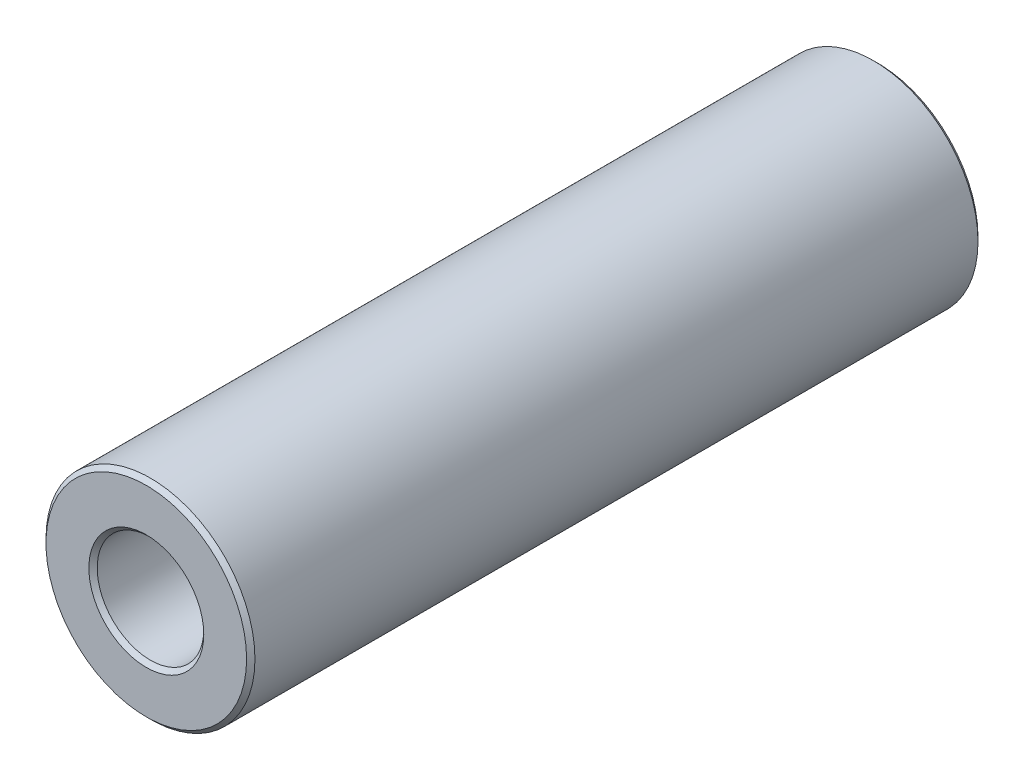
ISO-10303-21;
HEADER;
FILE_DESCRIPTION(('STEP AP214'),'2;1');
FILE_NAME('part.step','',(''),(''),'','','');
FILE_SCHEMA(('AUTOMOTIVE_DESIGN { 1 0 10303 214 1 1 1 1 }'));
ENDSEC;
DATA;
#1=APPLICATION_CONTEXT('core data for automotive mechanical design processes');
#2=APPLICATION_PROTOCOL_DEFINITION('international standard','automotive_design',2000,#1);
#3=PRODUCT_CONTEXT('',#1,'mechanical');
#4=PRODUCT('Part','Part','',(#3));
#5=PRODUCT_RELATED_PRODUCT_CATEGORY('part','',(#4));
#6=PRODUCT_DEFINITION_FORMATION('','',#4);
#7=PRODUCT_DEFINITION_CONTEXT('part definition',#1,'design');
#8=PRODUCT_DEFINITION('design','',#6,#7);
#9=PRODUCT_DEFINITION_SHAPE('','',#8);
#10=(LENGTH_UNIT() NAMED_UNIT(*) SI_UNIT(.MILLI.,.METRE.));
#11=(NAMED_UNIT(*) PLANE_ANGLE_UNIT() SI_UNIT($,.RADIAN.));
#12=(NAMED_UNIT(*) SI_UNIT($,.STERADIAN.) SOLID_ANGLE_UNIT());
#13=UNCERTAINTY_MEASURE_WITH_UNIT(LENGTH_MEASURE(1.E-05),#10,'distance_accuracy_value','');
#14=(GEOMETRIC_REPRESENTATION_CONTEXT(3) GLOBAL_UNCERTAINTY_ASSIGNED_CONTEXT((#13)) GLOBAL_UNIT_ASSIGNED_CONTEXT((#10,
#11,#12)) REPRESENTATION_CONTEXT('',''));
#15=CARTESIAN_POINT('',(0.,0.,0.));
#16=DIRECTION('',(0.,0.,1.));
#17=DIRECTION('',(1.,0.,0.));
#18=AXIS2_PLACEMENT_3D('',#15,#16,#17);
#19=CARTESIAN_POINT('',(0.,0.,35.));
#20=DIRECTION('',(0.,0.,1.));
#21=DIRECTION('',(1.,0.,0.));
#22=AXIS2_PLACEMENT_3D('',#19,#20,#21);
#23=PLANE('',#22);
#24=CARTESIAN_POINT('',(0.,0.,35.));
#25=DIRECTION('',(0.,0.,1.));
#26=DIRECTION('',(1.,0.,0.));
#27=AXIS2_PLACEMENT_3D('',#24,#25,#26);
#28=CIRCLE('',#27,2.75000000000001);
#29=CARTESIAN_POINT('',(2.75000000000001,0.,35.));
#30=VERTEX_POINT('',#29);
#31=EDGE_CURVE('E10',#30,#30,#28,.F.);
#32=ORIENTED_EDGE('',*,*,#31,.T.);
#33=EDGE_LOOP('',(#32));
#34=FACE_BOUND('',#33,.T.);
#35=CARTESIAN_POINT('',(0.,0.,35.));
#36=DIRECTION('',(0.,0.,1.));
#37=DIRECTION('',(1.,0.,0.));
#38=AXIS2_PLACEMENT_3D('',#35,#36,#37);
#39=CIRCLE('',#38,4.79999999999999);
#40=CARTESIAN_POINT('',(4.79999999999999,0.,35.));
#41=VERTEX_POINT('',#40);
#42=EDGE_CURVE('E39',#41,#41,#39,.T.);
#43=ORIENTED_EDGE('',*,*,#42,.T.);
#44=EDGE_LOOP('',(#43));
#45=FACE_BOUND('',#44,.T.);
#46=ADVANCED_FACE('F32',(#34,#45),#23,.T.);
#47=CARTESIAN_POINT('',(0.,0.,0.));
#48=DIRECTION('',(0.,0.,1.));
#49=DIRECTION('',(1.,0.,0.));
#50=AXIS2_PLACEMENT_3D('',#47,#48,#49);
#51=PLANE('',#50);
#52=CARTESIAN_POINT('',(0.,0.,0.));
#53=DIRECTION('',(0.,0.,1.));
#54=DIRECTION('',(1.,0.,0.));
#55=AXIS2_PLACEMENT_3D('',#52,#53,#54);
#56=CIRCLE('',#55,4.8);
#57=CARTESIAN_POINT('',(4.8,0.,0.));
#58=VERTEX_POINT('',#57);
#59=EDGE_CURVE('E52',#58,#58,#56,.F.);
#60=ORIENTED_EDGE('',*,*,#59,.T.);
#61=EDGE_LOOP('',(#60));
#62=FACE_BOUND('',#61,.T.);
#63=CARTESIAN_POINT('',(0.,0.,0.));
#64=DIRECTION('',(0.,0.,1.));
#65=DIRECTION('',(1.,0.,0.));
#66=AXIS2_PLACEMENT_3D('',#63,#64,#65);
#67=CIRCLE('',#66,2.75);
#68=CARTESIAN_POINT('',(2.75,0.,0.));
#69=VERTEX_POINT('',#68);
#70=EDGE_CURVE('E55',#69,#69,#67,.T.);
#71=ORIENTED_EDGE('',*,*,#70,.T.);
#72=EDGE_LOOP('',(#71));
#73=FACE_BOUND('',#72,.T.);
#74=ADVANCED_FACE('F76',(#62,#73),#51,.F.);
#75=CARTESIAN_POINT('',(0.,0.,35.));
#76=DIRECTION('',(0.,0.,-1.));
#77=DIRECTION('',(-1.,0.,0.));
#78=AXIS2_PLACEMENT_3D('',#75,#76,#77);
#79=CYLINDRICAL_SURFACE('',#78,5.);
#80=CARTESIAN_POINT('',(0.,0.,0.199999999999999));
#81=DIRECTION('',(0.,0.,1.));
#82=DIRECTION('',(1.,0.,0.));
#83=AXIS2_PLACEMENT_3D('',#80,#81,#82);
#84=CIRCLE('',#83,5.);
#85=CARTESIAN_POINT('',(5.,0.,0.199999999999999));
#86=VERTEX_POINT('',#85);
#87=EDGE_CURVE('E58',#86,#86,#84,.T.);
#88=ORIENTED_EDGE('',*,*,#87,.T.);
#89=EDGE_LOOP('',(#88));
#90=FACE_BOUND('',#89,.T.);
#91=CARTESIAN_POINT('',(0.,0.,34.8));
#92=DIRECTION('',(0.,0.,1.));
#93=DIRECTION('',(1.,0.,0.));
#94=AXIS2_PLACEMENT_3D('',#91,#92,#93);
#95=CIRCLE('',#94,5.);
#96=CARTESIAN_POINT('',(5.,0.,34.8));
#97=VERTEX_POINT('',#96);
#98=EDGE_CURVE('E61',#97,#97,#95,.F.);
#99=ORIENTED_EDGE('',*,*,#98,.T.);
#100=EDGE_LOOP('',(#99));
#101=FACE_BOUND('',#100,.T.);
#102=ADVANCED_FACE('F65',(#90,#101),#79,.T.);
#103=CARTESIAN_POINT('',(0.,0.,35.));
#104=DIRECTION('',(0.,0.,-1.));
#105=DIRECTION('',(-1.,0.,0.));
#106=AXIS2_PLACEMENT_3D('',#103,#104,#105);
#107=CYLINDRICAL_SURFACE('',#106,2.55);
#108=CARTESIAN_POINT('',(0.,0.,0.199999999999999));
#109=DIRECTION('',(0.,0.,1.));
#110=DIRECTION('',(1.,0.,0.));
#111=AXIS2_PLACEMENT_3D('',#108,#109,#110);
#112=CIRCLE('',#111,2.55);
#113=CARTESIAN_POINT('',(2.55,0.,0.199999999999999));
#114=VERTEX_POINT('',#113);
#115=EDGE_CURVE('E43',#114,#114,#112,.F.);
#116=ORIENTED_EDGE('',*,*,#115,.T.);
#117=EDGE_LOOP('',(#116));
#118=FACE_BOUND('',#117,.T.);
#119=CARTESIAN_POINT('',(0.,0.,34.8));
#120=DIRECTION('',(0.,0.,1.));
#121=DIRECTION('',(1.,0.,0.));
#122=AXIS2_PLACEMENT_3D('',#119,#120,#121);
#123=CIRCLE('',#122,2.55);
#124=CARTESIAN_POINT('',(2.55,0.,34.8));
#125=VERTEX_POINT('',#124);
#126=EDGE_CURVE('E47',#125,#125,#123,.T.);
#127=ORIENTED_EDGE('',*,*,#126,.T.);
#128=EDGE_LOOP('',(#127));
#129=FACE_BOUND('',#128,.T.);
#130=ADVANCED_FACE('F84',(#118,#129),#107,.F.);
#131=CARTESIAN_POINT('',(0.,0.,0.199999999999999));
#132=DIRECTION('',(0.,0.,1.));
#133=DIRECTION('',(1.,0.,0.));
#134=AXIS2_PLACEMENT_3D('',#131,#132,#133);
#135=CONICAL_SURFACE('',#134,5.,0.785398163397446);
#136=ORIENTED_EDGE('',*,*,#59,.F.);
#137=EDGE_LOOP('',(#136));
#138=FACE_BOUND('',#137,.T.);
#139=ORIENTED_EDGE('',*,*,#87,.F.);
#140=EDGE_LOOP('',(#139));
#141=FACE_BOUND('',#140,.T.);
#142=ADVANCED_FACE('F89',(#138,#141),#135,.T.);
#143=CARTESIAN_POINT('',(0.,0.,0.));
#144=DIRECTION('',(0.,0.,-1.));
#145=DIRECTION('',(-1.,0.,0.));
#146=AXIS2_PLACEMENT_3D('',#143,#144,#145);
#147=CONICAL_SURFACE('',#146,2.75,0.785398163397449);
#148=ORIENTED_EDGE('',*,*,#115,.F.);
#149=EDGE_LOOP('',(#148));
#150=FACE_BOUND('',#149,.T.);
#151=ORIENTED_EDGE('',*,*,#70,.F.);
#152=EDGE_LOOP('',(#151));
#153=FACE_BOUND('',#152,.T.);
#154=ADVANCED_FACE('F73',(#150,#153),#147,.F.);
#155=CARTESIAN_POINT('',(0.,0.,34.8));
#156=DIRECTION('',(0.,0.,1.));
#157=DIRECTION('',(1.,0.,0.));
#158=AXIS2_PLACEMENT_3D('',#155,#156,#157);
#159=CONICAL_SURFACE('',#158,2.55,0.785398163397449);
#160=ORIENTED_EDGE('',*,*,#31,.F.);
#161=EDGE_LOOP('',(#160));
#162=FACE_BOUND('',#161,.T.);
#163=ORIENTED_EDGE('',*,*,#126,.F.);
#164=EDGE_LOOP('',(#163));
#165=FACE_BOUND('',#164,.T.);
#166=ADVANCED_FACE('F69',(#162,#165),#159,.F.);
#167=CARTESIAN_POINT('',(0.,0.,35.));
#168=DIRECTION('',(0.,0.,-1.));
#169=DIRECTION('',(-1.,0.,0.));
#170=AXIS2_PLACEMENT_3D('',#167,#168,#169);
#171=CONICAL_SURFACE('',#170,4.79999999999999,0.785398163397472);
#172=ORIENTED_EDGE('',*,*,#98,.F.);
#173=EDGE_LOOP('',(#172));
#174=FACE_BOUND('',#173,.T.);
#175=ORIENTED_EDGE('',*,*,#42,.F.);
#176=EDGE_LOOP('',(#175));
#177=FACE_BOUND('',#176,.T.);
#178=ADVANCED_FACE('F34',(#174,#177),#171,.T.);
#179=CLOSED_SHELL('',(#46,#74,#102,#130,#142,#154,#166,#178));
#180=MANIFOLD_SOLID_BREP('B2',#179);
#181=ADVANCED_BREP_SHAPE_REPRESENTATION('',(#18,#180),#14);
#182=SHAPE_DEFINITION_REPRESENTATION(#9,#181);
ENDSEC;
END-ISO-10303-21;
